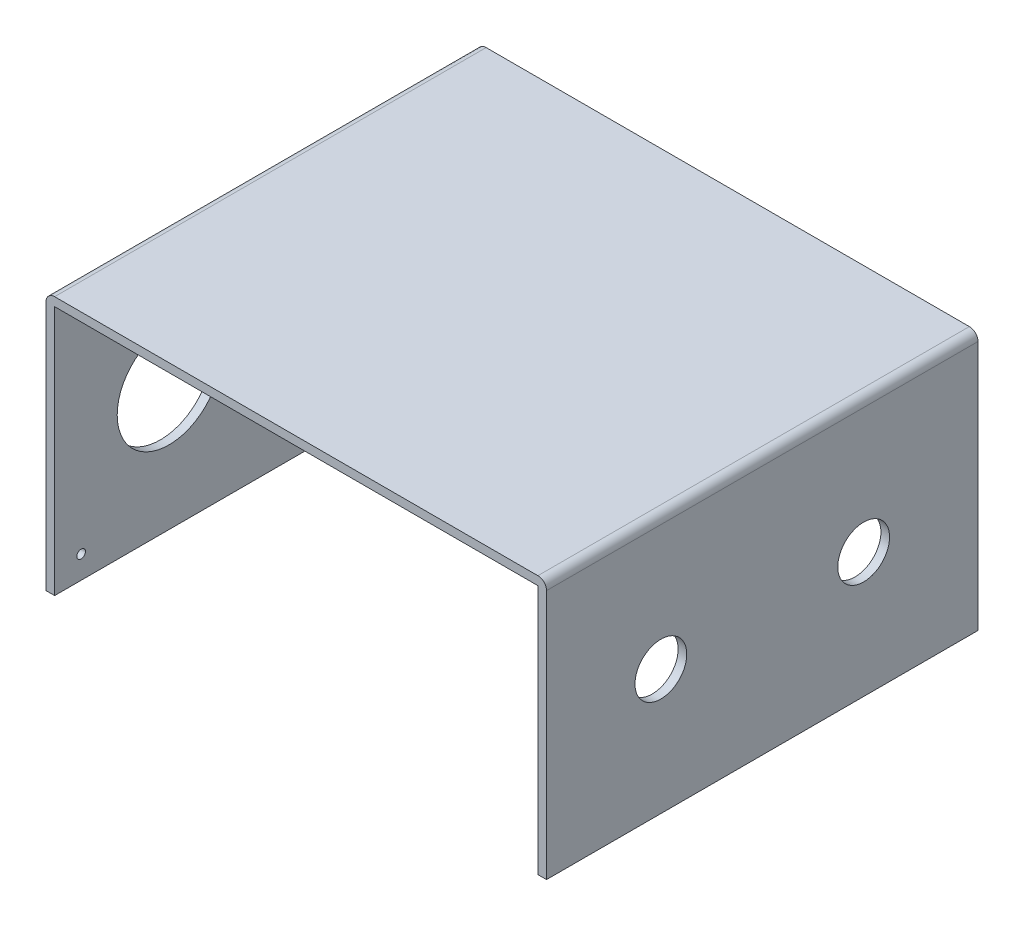
ISO-10303-21;
HEADER;
FILE_DESCRIPTION(('STEP AP214'),'2;1');
FILE_NAME('part.step','',(''),(''),'','','');
FILE_SCHEMA(('AUTOMOTIVE_DESIGN { 1 0 10303 214 1 1 1 1 }'));
ENDSEC;
DATA;
#1=APPLICATION_CONTEXT('core data for automotive mechanical design processes');
#2=APPLICATION_PROTOCOL_DEFINITION('international standard','automotive_design',2000,#1);
#3=PRODUCT_CONTEXT('',#1,'mechanical');
#4=PRODUCT('Part','Part','',(#3));
#5=PRODUCT_RELATED_PRODUCT_CATEGORY('part','',(#4));
#6=PRODUCT_DEFINITION_FORMATION('','',#4);
#7=PRODUCT_DEFINITION_CONTEXT('part definition',#1,'design');
#8=PRODUCT_DEFINITION('design','',#6,#7);
#9=PRODUCT_DEFINITION_SHAPE('','',#8);
#10=(LENGTH_UNIT() NAMED_UNIT(*) SI_UNIT(.MILLI.,.METRE.));
#11=(NAMED_UNIT(*) PLANE_ANGLE_UNIT() SI_UNIT($,.RADIAN.));
#12=(NAMED_UNIT(*) SI_UNIT($,.STERADIAN.) SOLID_ANGLE_UNIT());
#13=UNCERTAINTY_MEASURE_WITH_UNIT(LENGTH_MEASURE(1.E-05),#10,'distance_accuracy_value','');
#14=(GEOMETRIC_REPRESENTATION_CONTEXT(3) GLOBAL_UNCERTAINTY_ASSIGNED_CONTEXT((#13)) GLOBAL_UNIT_ASSIGNED_CONTEXT((#10,
#11,#12)) REPRESENTATION_CONTEXT('',''));
#15=CARTESIAN_POINT('',(0.,0.,0.));
#16=DIRECTION('',(0.,0.,1.));
#17=DIRECTION('',(1.,0.,0.));
#18=AXIS2_PLACEMENT_3D('',#15,#16,#17);
#19=CARTESIAN_POINT('',(57.,29.,50.));
#20=DIRECTION('',(1.,0.,0.));
#21=DIRECTION('',(0.,0.,-1.));
#22=AXIS2_PLACEMENT_3D('',#19,#20,#21);
#23=PLANE('',#22);
#24=CARTESIAN_POINT('',(57.,14.5,36.75));
#25=DIRECTION('',(1.,0.,0.));
#26=DIRECTION('',(0.,0.,-1.));
#27=AXIS2_PLACEMENT_3D('',#24,#25,#26);
#28=CIRCLE('',#27,3.);
#29=CARTESIAN_POINT('',(57.,14.5,33.75));
#30=VERTEX_POINT('',#29);
#31=EDGE_CURVE('E147',#30,#30,#28,.T.);
#32=ORIENTED_EDGE('',*,*,#31,.T.);
#33=EDGE_LOOP('',(#32));
#34=FACE_BOUND('',#33,.T.);
#35=CARTESIAN_POINT('',(57.,14.5,13.25));
#36=DIRECTION('',(1.,0.,0.));
#37=DIRECTION('',(0.,0.,-1.));
#38=AXIS2_PLACEMENT_3D('',#35,#36,#37);
#39=CIRCLE('',#38,3.);
#40=CARTESIAN_POINT('',(57.,14.5,10.25));
#41=VERTEX_POINT('',#40);
#42=EDGE_CURVE('E204',#41,#41,#39,.T.);
#43=ORIENTED_EDGE('',*,*,#42,.T.);
#44=EDGE_LOOP('',(#43));
#45=FACE_BOUND('',#44,.T.);
#46=DIRECTION('',(0.,1.,0.));
#47=VECTOR('',#46,1.);
#48=CARTESIAN_POINT('',(57.,29.,0.));
#49=LINE('',#48,#47);
#50=CARTESIAN_POINT('',(57.,29.,0.));
#51=VERTEX_POINT('',#50);
#52=CARTESIAN_POINT('',(57.,0.,0.));
#53=VERTEX_POINT('',#52);
#54=EDGE_CURVE('E143',#51,#53,#49,.F.);
#55=ORIENTED_EDGE('',*,*,#54,.T.);
#56=DIRECTION('',(0.,0.,-1.));
#57=VECTOR('',#56,1.);
#58=CARTESIAN_POINT('',(57.,0.,50.));
#59=LINE('',#58,#57);
#60=CARTESIAN_POINT('',(57.,0.,50.));
#61=VERTEX_POINT('',#60);
#62=EDGE_CURVE('E11',#61,#53,#59,.T.);
#63=ORIENTED_EDGE('',*,*,#62,.F.);
#64=DIRECTION('',(0.,1.,0.));
#65=VECTOR('',#64,1.);
#66=CARTESIAN_POINT('',(57.,29.,50.));
#67=LINE('',#66,#65);
#68=CARTESIAN_POINT('',(57.,29.,50.));
#69=VERTEX_POINT('',#68);
#70=EDGE_CURVE('E95',#69,#61,#67,.F.);
#71=ORIENTED_EDGE('',*,*,#70,.F.);
#72=DIRECTION('',(0.,0.,-1.));
#73=VECTOR('',#72,1.);
#74=CARTESIAN_POINT('',(57.,29.,50.));
#75=LINE('',#74,#73);
#76=EDGE_CURVE('E142',#69,#51,#75,.T.);
#77=ORIENTED_EDGE('',*,*,#76,.T.);
#78=EDGE_LOOP('',(#55,#63,#71,#77));
#79=FACE_BOUND('',#78,.T.);
#80=ADVANCED_FACE('F32',(#34,#45,#79),#23,.F.);
#81=CARTESIAN_POINT('',(58.,0.,50.));
#82=DIRECTION('',(0.,-1.,0.));
#83=DIRECTION('',(0.,0.,-1.));
#84=AXIS2_PLACEMENT_3D('',#81,#82,#83);
#85=PLANE('',#84);
#86=DIRECTION('',(-1.,0.,0.));
#87=VECTOR('',#86,1.);
#88=CARTESIAN_POINT('',(58.,0.,0.));
#89=LINE('',#88,#87);
#90=CARTESIAN_POINT('',(58.,0.,0.));
#91=VERTEX_POINT('',#90);
#92=EDGE_CURVE('E146',#91,#53,#89,.T.);
#93=ORIENTED_EDGE('',*,*,#92,.F.);
#94=DIRECTION('',(0.,0.,-1.));
#95=VECTOR('',#94,1.);
#96=CARTESIAN_POINT('',(58.,0.,50.));
#97=LINE('',#96,#95);
#98=CARTESIAN_POINT('',(58.,0.,50.));
#99=VERTEX_POINT('',#98);
#100=EDGE_CURVE('E41',#99,#91,#97,.T.);
#101=ORIENTED_EDGE('',*,*,#100,.F.);
#102=DIRECTION('',(-1.,0.,0.));
#103=VECTOR('',#102,1.);
#104=CARTESIAN_POINT('',(58.,0.,50.));
#105=LINE('',#104,#103);
#106=EDGE_CURVE('E210',#99,#61,#105,.T.);
#107=ORIENTED_EDGE('',*,*,#106,.T.);
#108=ORIENTED_EDGE('',*,*,#62,.T.);
#109=EDGE_LOOP('',(#93,#101,#107,#108));
#110=FACE_BOUND('',#109,.T.);
#111=ADVANCED_FACE('F248',(#110),#85,.T.);
#112=CARTESIAN_POINT('',(58.,29.,50.));
#113=DIRECTION('',(1.,0.,0.));
#114=DIRECTION('',(0.,0.,-1.));
#115=AXIS2_PLACEMENT_3D('',#112,#113,#114);
#116=PLANE('',#115);
#117=CARTESIAN_POINT('',(58.,14.5,36.75));
#118=DIRECTION('',(1.,0.,0.));
#119=DIRECTION('',(0.,0.,-1.));
#120=AXIS2_PLACEMENT_3D('',#117,#118,#119);
#121=CIRCLE('',#120,3.);
#122=CARTESIAN_POINT('',(58.,14.5,33.75));
#123=VERTEX_POINT('',#122);
#124=EDGE_CURVE('E183',#123,#123,#121,.T.);
#125=ORIENTED_EDGE('',*,*,#124,.F.);
#126=EDGE_LOOP('',(#125));
#127=FACE_BOUND('',#126,.T.);
#128=CARTESIAN_POINT('',(58.,14.5,13.25));
#129=DIRECTION('',(1.,0.,0.));
#130=DIRECTION('',(0.,0.,-1.));
#131=AXIS2_PLACEMENT_3D('',#128,#129,#130);
#132=CIRCLE('',#131,3.);
#133=CARTESIAN_POINT('',(58.,14.5,10.25));
#134=VERTEX_POINT('',#133);
#135=EDGE_CURVE('E186',#134,#134,#132,.T.);
#136=ORIENTED_EDGE('',*,*,#135,.F.);
#137=EDGE_LOOP('',(#136));
#138=FACE_BOUND('',#137,.T.);
#139=DIRECTION('',(0.,-1.,0.));
#140=VECTOR('',#139,1.);
#141=CARTESIAN_POINT('',(58.,29.,0.));
#142=LINE('',#141,#140);
#143=CARTESIAN_POINT('',(58.,29.,0.));
#144=VERTEX_POINT('',#143);
#145=EDGE_CURVE('E150',#144,#91,#142,.T.);
#146=ORIENTED_EDGE('',*,*,#145,.F.);
#147=DIRECTION('',(0.,0.,-1.));
#148=VECTOR('',#147,1.);
#149=CARTESIAN_POINT('',(58.,29.,50.));
#150=LINE('',#149,#148);
#151=CARTESIAN_POINT('',(58.,29.,50.));
#152=VERTEX_POINT('',#151);
#153=EDGE_CURVE('E177',#152,#144,#150,.T.);
#154=ORIENTED_EDGE('',*,*,#153,.F.);
#155=DIRECTION('',(0.,-1.,0.));
#156=VECTOR('',#155,1.);
#157=CARTESIAN_POINT('',(58.,29.,50.));
#158=LINE('',#157,#156);
#159=EDGE_CURVE('E213',#152,#99,#158,.T.);
#160=ORIENTED_EDGE('',*,*,#159,.T.);
#161=ORIENTED_EDGE('',*,*,#100,.T.);
#162=EDGE_LOOP('',(#146,#154,#160,#161));
#163=FACE_BOUND('',#162,.T.);
#164=ADVANCED_FACE('F253',(#127,#138,#163),#116,.T.);
#165=CARTESIAN_POINT('',(57.,29.,50.));
#166=DIRECTION('',(0.,0.,-1.));
#167=DIRECTION('',(-1.,0.,0.));
#168=AXIS2_PLACEMENT_3D('',#165,#166,#167);
#169=CYLINDRICAL_SURFACE('',#168,1.);
#170=CARTESIAN_POINT('',(57.,29.,0.));
#171=DIRECTION('',(0.,0.,-1.));
#172=DIRECTION('',(-1.,0.,0.));
#173=AXIS2_PLACEMENT_3D('',#170,#171,#172);
#174=CIRCLE('',#173,1.);
#175=CARTESIAN_POINT('',(57.,30.,0.));
#176=VERTEX_POINT('',#175);
#177=EDGE_CURVE('E153',#176,#144,#174,.T.);
#178=ORIENTED_EDGE('',*,*,#177,.F.);
#179=DIRECTION('',(0.,0.,-1.));
#180=VECTOR('',#179,1.);
#181=CARTESIAN_POINT('',(57.,30.,50.));
#182=LINE('',#181,#180);
#183=CARTESIAN_POINT('',(57.,30.,50.));
#184=VERTEX_POINT('',#183);
#185=EDGE_CURVE('E175',#184,#176,#182,.T.);
#186=ORIENTED_EDGE('',*,*,#185,.F.);
#187=CARTESIAN_POINT('',(57.,29.,50.));
#188=DIRECTION('',(0.,0.,-1.));
#189=DIRECTION('',(-1.,0.,0.));
#190=AXIS2_PLACEMENT_3D('',#187,#188,#189);
#191=CIRCLE('',#190,1.);
#192=EDGE_CURVE('E216',#184,#152,#191,.T.);
#193=ORIENTED_EDGE('',*,*,#192,.T.);
#194=ORIENTED_EDGE('',*,*,#153,.T.);
#195=EDGE_LOOP('',(#178,#186,#193,#194));
#196=FACE_BOUND('',#195,.T.);
#197=ADVANCED_FACE('F375',(#196),#169,.T.);
#198=CARTESIAN_POINT('',(1.00000000000001,30.,50.));
#199=DIRECTION('',(0.,1.,0.));
#200=DIRECTION('',(0.,0.,1.));
#201=AXIS2_PLACEMENT_3D('',#198,#199,#200);
#202=PLANE('',#201);
#203=DIRECTION('',(1.,0.,0.));
#204=VECTOR('',#203,1.);
#205=CARTESIAN_POINT('',(1.00000000000001,30.,0.));
#206=LINE('',#205,#204);
#207=CARTESIAN_POINT('',(1.00000000000001,30.,0.));
#208=VERTEX_POINT('',#207);
#209=EDGE_CURVE('E156',#208,#176,#206,.T.);
#210=ORIENTED_EDGE('',*,*,#209,.F.);
#211=DIRECTION('',(0.,0.,-1.));
#212=VECTOR('',#211,1.);
#213=CARTESIAN_POINT('',(1.00000000000001,30.,50.));
#214=LINE('',#213,#212);
#215=CARTESIAN_POINT('',(1.00000000000001,30.,50.));
#216=VERTEX_POINT('',#215);
#217=EDGE_CURVE('E173',#216,#208,#214,.T.);
#218=ORIENTED_EDGE('',*,*,#217,.F.);
#219=DIRECTION('',(1.,0.,0.));
#220=VECTOR('',#219,1.);
#221=CARTESIAN_POINT('',(1.00000000000001,30.,50.));
#222=LINE('',#221,#220);
#223=EDGE_CURVE('E219',#216,#184,#222,.T.);
#224=ORIENTED_EDGE('',*,*,#223,.T.);
#225=ORIENTED_EDGE('',*,*,#185,.T.);
#226=EDGE_LOOP('',(#210,#218,#224,#225));
#227=FACE_BOUND('',#226,.T.);
#228=ADVANCED_FACE('F366',(#227),#202,.T.);
#229=CARTESIAN_POINT('',(1.,29.,50.));
#230=DIRECTION('',(0.,0.,-1.));
#231=DIRECTION('',(-1.,0.,0.));
#232=AXIS2_PLACEMENT_3D('',#229,#230,#231);
#233=CYLINDRICAL_SURFACE('',#232,1.);
#234=CARTESIAN_POINT('',(1.,29.,0.));
#235=DIRECTION('',(0.,0.,-1.));
#236=DIRECTION('',(-1.,0.,0.));
#237=AXIS2_PLACEMENT_3D('',#234,#235,#236);
#238=CIRCLE('',#237,1.);
#239=CARTESIAN_POINT('',(0.,29.,0.));
#240=VERTEX_POINT('',#239);
#241=EDGE_CURVE('E159',#240,#208,#238,.T.);
#242=ORIENTED_EDGE('',*,*,#241,.F.);
#243=DIRECTION('',(0.,0.,-1.));
#244=VECTOR('',#243,1.);
#245=CARTESIAN_POINT('',(0.,29.,50.));
#246=LINE('',#245,#244);
#247=CARTESIAN_POINT('',(0.,29.,50.));
#248=VERTEX_POINT('',#247);
#249=EDGE_CURVE('E171',#248,#240,#246,.T.);
#250=ORIENTED_EDGE('',*,*,#249,.F.);
#251=CARTESIAN_POINT('',(1.,29.,50.));
#252=DIRECTION('',(0.,0.,-1.));
#253=DIRECTION('',(-1.,0.,0.));
#254=AXIS2_PLACEMENT_3D('',#251,#252,#253);
#255=CIRCLE('',#254,1.);
#256=EDGE_CURVE('E137',#248,#216,#255,.T.);
#257=ORIENTED_EDGE('',*,*,#256,.T.);
#258=ORIENTED_EDGE('',*,*,#217,.T.);
#259=EDGE_LOOP('',(#242,#250,#257,#258));
#260=FACE_BOUND('',#259,.T.);
#261=ADVANCED_FACE('F224',(#260),#233,.T.);
#262=CARTESIAN_POINT('',(0.,0.,50.));
#263=DIRECTION('',(-1.,0.,0.));
#264=DIRECTION('',(0.,0.,1.));
#265=AXIS2_PLACEMENT_3D('',#262,#263,#264);
#266=PLANE('',#265);
#267=CARTESIAN_POINT('',(0.,14.5,36.75));
#268=DIRECTION('',(-1.,0.,0.));
#269=DIRECTION('',(0.,0.,1.));
#270=AXIS2_PLACEMENT_3D('',#267,#268,#269);
#271=CIRCLE('',#270,6.);
#272=CARTESIAN_POINT('',(0.,14.5,42.75));
#273=VERTEX_POINT('',#272);
#274=EDGE_CURVE('E197',#273,#273,#271,.T.);
#275=ORIENTED_EDGE('',*,*,#274,.F.);
#276=EDGE_LOOP('',(#275));
#277=FACE_BOUND('',#276,.T.);
#278=CARTESIAN_POINT('',(0.,2.6361938949941,46.9263199023199));
#279=DIRECTION('',(-1.,0.,0.));
#280=DIRECTION('',(0.,0.,1.));
#281=AXIS2_PLACEMENT_3D('',#278,#279,#280);
#282=CIRCLE('',#281,0.499999999999999);
#283=CARTESIAN_POINT('',(0.,2.6361938949941,47.4263199023199));
#284=VERTEX_POINT('',#283);
#285=EDGE_CURVE('E187',#284,#284,#282,.T.);
#286=ORIENTED_EDGE('',*,*,#285,.F.);
#287=EDGE_LOOP('',(#286));
#288=FACE_BOUND('',#287,.T.);
#289=CARTESIAN_POINT('',(0.,14.5,13.25));
#290=DIRECTION('',(-1.,0.,0.));
#291=DIRECTION('',(0.,0.,1.));
#292=AXIS2_PLACEMENT_3D('',#289,#290,#291);
#293=CIRCLE('',#292,3.);
#294=CARTESIAN_POINT('',(0.,14.5,16.25));
#295=VERTEX_POINT('',#294);
#296=EDGE_CURVE('E182',#295,#295,#293,.T.);
#297=ORIENTED_EDGE('',*,*,#296,.F.);
#298=EDGE_LOOP('',(#297));
#299=FACE_BOUND('',#298,.T.);
#300=DIRECTION('',(0.,1.,0.));
#301=VECTOR('',#300,1.);
#302=CARTESIAN_POINT('',(0.,0.,0.));
#303=LINE('',#302,#301);
#304=CARTESIAN_POINT('',(0.,0.,0.));
#305=VERTEX_POINT('',#304);
#306=EDGE_CURVE('E162',#305,#240,#303,.T.);
#307=ORIENTED_EDGE('',*,*,#306,.F.);
#308=DIRECTION('',(0.,0.,-1.));
#309=VECTOR('',#308,1.);
#310=CARTESIAN_POINT('',(0.,0.,50.));
#311=LINE('',#310,#309);
#312=CARTESIAN_POINT('',(0.,0.,50.));
#313=VERTEX_POINT('',#312);
#314=EDGE_CURVE('E125',#313,#305,#311,.T.);
#315=ORIENTED_EDGE('',*,*,#314,.F.);
#316=DIRECTION('',(0.,1.,0.));
#317=VECTOR('',#316,1.);
#318=CARTESIAN_POINT('',(0.,0.,50.));
#319=LINE('',#318,#317);
#320=EDGE_CURVE('E135',#313,#248,#319,.T.);
#321=ORIENTED_EDGE('',*,*,#320,.T.);
#322=ORIENTED_EDGE('',*,*,#249,.T.);
#323=EDGE_LOOP('',(#307,#315,#321,#322));
#324=FACE_BOUND('',#323,.T.);
#325=ADVANCED_FACE('F230',(#277,#288,#299,#324),#266,.T.);
#326=CARTESIAN_POINT('',(1.,0.,50.));
#327=DIRECTION('',(0.,-1.,0.));
#328=DIRECTION('',(0.,0.,-1.));
#329=AXIS2_PLACEMENT_3D('',#326,#327,#328);
#330=PLANE('',#329);
#331=DIRECTION('',(-1.,0.,0.));
#332=VECTOR('',#331,1.);
#333=CARTESIAN_POINT('',(1.,0.,0.));
#334=LINE('',#333,#332);
#335=CARTESIAN_POINT('',(1.,0.,0.));
#336=VERTEX_POINT('',#335);
#337=EDGE_CURVE('E124',#336,#305,#334,.T.);
#338=ORIENTED_EDGE('',*,*,#337,.F.);
#339=DIRECTION('',(0.,0.,-1.));
#340=VECTOR('',#339,1.);
#341=CARTESIAN_POINT('',(1.,0.,50.));
#342=LINE('',#341,#340);
#343=CARTESIAN_POINT('',(1.,0.,50.));
#344=VERTEX_POINT('',#343);
#345=EDGE_CURVE('E118',#344,#336,#342,.T.);
#346=ORIENTED_EDGE('',*,*,#345,.F.);
#347=DIRECTION('',(-1.,0.,0.));
#348=VECTOR('',#347,1.);
#349=CARTESIAN_POINT('',(1.,0.,50.));
#350=LINE('',#349,#348);
#351=EDGE_CURVE('E122',#344,#313,#350,.T.);
#352=ORIENTED_EDGE('',*,*,#351,.T.);
#353=ORIENTED_EDGE('',*,*,#314,.T.);
#354=EDGE_LOOP('',(#338,#346,#352,#353));
#355=FACE_BOUND('',#354,.T.);
#356=ADVANCED_FACE('F120',(#355),#330,.T.);
#357=CARTESIAN_POINT('',(1.,0.,50.));
#358=DIRECTION('',(-1.,0.,0.));
#359=DIRECTION('',(0.,0.,1.));
#360=AXIS2_PLACEMENT_3D('',#357,#358,#359);
#361=PLANE('',#360);
#362=CARTESIAN_POINT('',(1.,14.5,36.75));
#363=DIRECTION('',(-1.,0.,0.));
#364=DIRECTION('',(0.,0.,1.));
#365=AXIS2_PLACEMENT_3D('',#362,#363,#364);
#366=CIRCLE('',#365,6.);
#367=CARTESIAN_POINT('',(1.,14.5,42.75));
#368=VERTEX_POINT('',#367);
#369=EDGE_CURVE('E35',#368,#368,#366,.T.);
#370=ORIENTED_EDGE('',*,*,#369,.T.);
#371=EDGE_LOOP('',(#370));
#372=FACE_BOUND('',#371,.T.);
#373=CARTESIAN_POINT('',(1.,2.6361938949941,46.9263199023199));
#374=DIRECTION('',(-1.,0.,0.));
#375=DIRECTION('',(0.,0.,1.));
#376=AXIS2_PLACEMENT_3D('',#373,#374,#375);
#377=CIRCLE('',#376,0.499999999999999);
#378=CARTESIAN_POINT('',(1.,2.6361938949941,47.4263199023199));
#379=VERTEX_POINT('',#378);
#380=EDGE_CURVE('E184',#379,#379,#377,.T.);
#381=ORIENTED_EDGE('',*,*,#380,.T.);
#382=EDGE_LOOP('',(#381));
#383=FACE_BOUND('',#382,.T.);
#384=CARTESIAN_POINT('',(1.,14.5,13.25));
#385=DIRECTION('',(-1.,0.,0.));
#386=DIRECTION('',(0.,0.,1.));
#387=AXIS2_PLACEMENT_3D('',#384,#385,#386);
#388=CIRCLE('',#387,3.);
#389=CARTESIAN_POINT('',(1.,14.5,16.25));
#390=VERTEX_POINT('',#389);
#391=EDGE_CURVE('E180',#390,#390,#388,.T.);
#392=ORIENTED_EDGE('',*,*,#391,.T.);
#393=EDGE_LOOP('',(#392));
#394=FACE_BOUND('',#393,.T.);
#395=DIRECTION('',(0.,1.,0.));
#396=VECTOR('',#395,1.);
#397=CARTESIAN_POINT('',(1.,0.,0.));
#398=LINE('',#397,#396);
#399=CARTESIAN_POINT('',(1.,29.,0.));
#400=VERTEX_POINT('',#399);
#401=EDGE_CURVE('E83',#336,#400,#398,.T.);
#402=ORIENTED_EDGE('',*,*,#401,.T.);
#403=DIRECTION('',(0.,0.,-1.));
#404=VECTOR('',#403,1.);
#405=CARTESIAN_POINT('',(1.,29.,50.));
#406=LINE('',#405,#404);
#407=CARTESIAN_POINT('',(1.,29.,50.));
#408=VERTEX_POINT('',#407);
#409=EDGE_CURVE('E126',#408,#400,#406,.T.);
#410=ORIENTED_EDGE('',*,*,#409,.F.);
#411=DIRECTION('',(0.,1.,0.));
#412=VECTOR('',#411,1.);
#413=CARTESIAN_POINT('',(1.,0.,50.));
#414=LINE('',#413,#412);
#415=EDGE_CURVE('E128',#344,#408,#414,.T.);
#416=ORIENTED_EDGE('',*,*,#415,.F.);
#417=ORIENTED_EDGE('',*,*,#345,.T.);
#418=EDGE_LOOP('',(#402,#410,#416,#417));
#419=FACE_BOUND('',#418,.T.);
#420=ADVANCED_FACE('F129',(#372,#383,#394,#419),#361,.F.);
#421=CARTESIAN_POINT('',(1.00000000000001,29.,50.));
#422=DIRECTION('',(0.,1.,0.));
#423=DIRECTION('',(0.,0.,1.));
#424=AXIS2_PLACEMENT_3D('',#421,#422,#423);
#425=PLANE('',#424);
#426=DIRECTION('',(1.,0.,0.));
#427=VECTOR('',#426,1.);
#428=CARTESIAN_POINT('',(1.00000000000001,29.,0.));
#429=LINE('',#428,#427);
#430=EDGE_CURVE('E89',#400,#51,#429,.T.);
#431=ORIENTED_EDGE('',*,*,#430,.T.);
#432=ORIENTED_EDGE('',*,*,#76,.F.);
#433=DIRECTION('',(1.,0.,0.));
#434=VECTOR('',#433,1.);
#435=CARTESIAN_POINT('',(1.00000000000001,29.,50.));
#436=LINE('',#435,#434);
#437=EDGE_CURVE('E50',#408,#69,#436,.T.);
#438=ORIENTED_EDGE('',*,*,#437,.F.);
#439=ORIENTED_EDGE('',*,*,#409,.T.);
#440=EDGE_LOOP('',(#431,#432,#438,#439));
#441=FACE_BOUND('',#440,.T.);
#442=ADVANCED_FACE('F236',(#441),#425,.F.);
#443=CARTESIAN_POINT('',(57.,29.,50.));
#444=DIRECTION('',(0.,0.,-1.));
#445=DIRECTION('',(-1.,0.,0.));
#446=AXIS2_PLACEMENT_3D('',#443,#444,#445);
#447=PLANE('',#446);
#448=ORIENTED_EDGE('',*,*,#70,.T.);
#449=ORIENTED_EDGE('',*,*,#106,.F.);
#450=ORIENTED_EDGE('',*,*,#159,.F.);
#451=ORIENTED_EDGE('',*,*,#192,.F.);
#452=ORIENTED_EDGE('',*,*,#223,.F.);
#453=ORIENTED_EDGE('',*,*,#256,.F.);
#454=ORIENTED_EDGE('',*,*,#320,.F.);
#455=ORIENTED_EDGE('',*,*,#351,.F.);
#456=ORIENTED_EDGE('',*,*,#415,.T.);
#457=ORIENTED_EDGE('',*,*,#437,.T.);
#458=EDGE_LOOP('',(#448,#449,#450,#451,#452,#453,#454,#455,#456,#457));
#459=FACE_BOUND('',#458,.T.);
#460=ADVANCED_FACE('F132',(#459),#447,.F.);
#461=CARTESIAN_POINT('',(57.,29.,0.));
#462=DIRECTION('',(0.,0.,-1.));
#463=DIRECTION('',(-1.,0.,0.));
#464=AXIS2_PLACEMENT_3D('',#461,#462,#463);
#465=PLANE('',#464);
#466=ORIENTED_EDGE('',*,*,#54,.F.);
#467=ORIENTED_EDGE('',*,*,#430,.F.);
#468=ORIENTED_EDGE('',*,*,#401,.F.);
#469=ORIENTED_EDGE('',*,*,#337,.T.);
#470=ORIENTED_EDGE('',*,*,#306,.T.);
#471=ORIENTED_EDGE('',*,*,#241,.T.);
#472=ORIENTED_EDGE('',*,*,#209,.T.);
#473=ORIENTED_EDGE('',*,*,#177,.T.);
#474=ORIENTED_EDGE('',*,*,#145,.T.);
#475=ORIENTED_EDGE('',*,*,#92,.T.);
#476=EDGE_LOOP('',(#466,#467,#468,#469,#470,#471,#472,#473,#474,#475));
#477=FACE_BOUND('',#476,.T.);
#478=ADVANCED_FACE('F233',(#477),#465,.T.);
#479=CARTESIAN_POINT('',(-20.,14.5,13.25));
#480=DIRECTION('',(1.,0.,0.));
#481=DIRECTION('',(0.,0.,-1.));
#482=AXIS2_PLACEMENT_3D('',#479,#480,#481);
#483=CYLINDRICAL_SURFACE('',#482,3.);
#484=ORIENTED_EDGE('',*,*,#296,.T.);
#485=EDGE_LOOP('',(#484));
#486=FACE_BOUND('',#485,.T.);
#487=ORIENTED_EDGE('',*,*,#391,.F.);
#488=EDGE_LOOP('',(#487));
#489=FACE_BOUND('',#488,.T.);
#490=ADVANCED_FACE('F262',(#486,#489),#483,.F.);
#491=ORIENTED_EDGE('',*,*,#135,.T.);
#492=EDGE_LOOP('',(#491));
#493=FACE_BOUND('',#492,.T.);
#494=ORIENTED_EDGE('',*,*,#42,.F.);
#495=EDGE_LOOP('',(#494));
#496=FACE_BOUND('',#495,.T.);
#497=ADVANCED_FACE('F259',(#493,#496),#483,.F.);
#498=CARTESIAN_POINT('',(-20.,14.5,36.75));
#499=DIRECTION('',(1.,0.,0.));
#500=DIRECTION('',(0.,0.,-1.));
#501=AXIS2_PLACEMENT_3D('',#498,#499,#500);
#502=CYLINDRICAL_SURFACE('',#501,3.);
#503=ORIENTED_EDGE('',*,*,#124,.T.);
#504=EDGE_LOOP('',(#503));
#505=FACE_BOUND('',#504,.T.);
#506=ORIENTED_EDGE('',*,*,#31,.F.);
#507=EDGE_LOOP('',(#506));
#508=FACE_BOUND('',#507,.T.);
#509=ADVANCED_FACE('F261',(#505,#508),#502,.F.);
#510=CARTESIAN_POINT('',(22.,2.6361938949941,46.9263199023199));
#511=DIRECTION('',(-1.,0.,0.));
#512=DIRECTION('',(0.,0.,1.));
#513=AXIS2_PLACEMENT_3D('',#510,#511,#512);
#514=CYLINDRICAL_SURFACE('',#513,0.499999999999999);
#515=ORIENTED_EDGE('',*,*,#285,.T.);
#516=EDGE_LOOP('',(#515));
#517=FACE_BOUND('',#516,.T.);
#518=ORIENTED_EDGE('',*,*,#380,.F.);
#519=EDGE_LOOP('',(#518));
#520=FACE_BOUND('',#519,.T.);
#521=ADVANCED_FACE('F269',(#517,#520),#514,.F.);
#522=CARTESIAN_POINT('',(22.,14.5,36.75));
#523=DIRECTION('',(-1.,0.,0.));
#524=DIRECTION('',(0.,0.,1.));
#525=AXIS2_PLACEMENT_3D('',#522,#523,#524);
#526=CYLINDRICAL_SURFACE('',#525,6.);
#527=ORIENTED_EDGE('',*,*,#274,.T.);
#528=EDGE_LOOP('',(#527));
#529=FACE_BOUND('',#528,.T.);
#530=ORIENTED_EDGE('',*,*,#369,.F.);
#531=EDGE_LOOP('',(#530));
#532=FACE_BOUND('',#531,.T.);
#533=ADVANCED_FACE('F306',(#529,#532),#526,.F.);
#534=CLOSED_SHELL('',(#80,#111,#164,#197,#228,#261,#325,#356,#420,#442,#460,#478,#490,#497,#509,
#521,#533));
#535=MANIFOLD_SOLID_BREP('B2',#534);
#536=ADVANCED_BREP_SHAPE_REPRESENTATION('',(#18,#535),#14);
#537=SHAPE_DEFINITION_REPRESENTATION(#9,#536);
ENDSEC;
END-ISO-10303-21;
